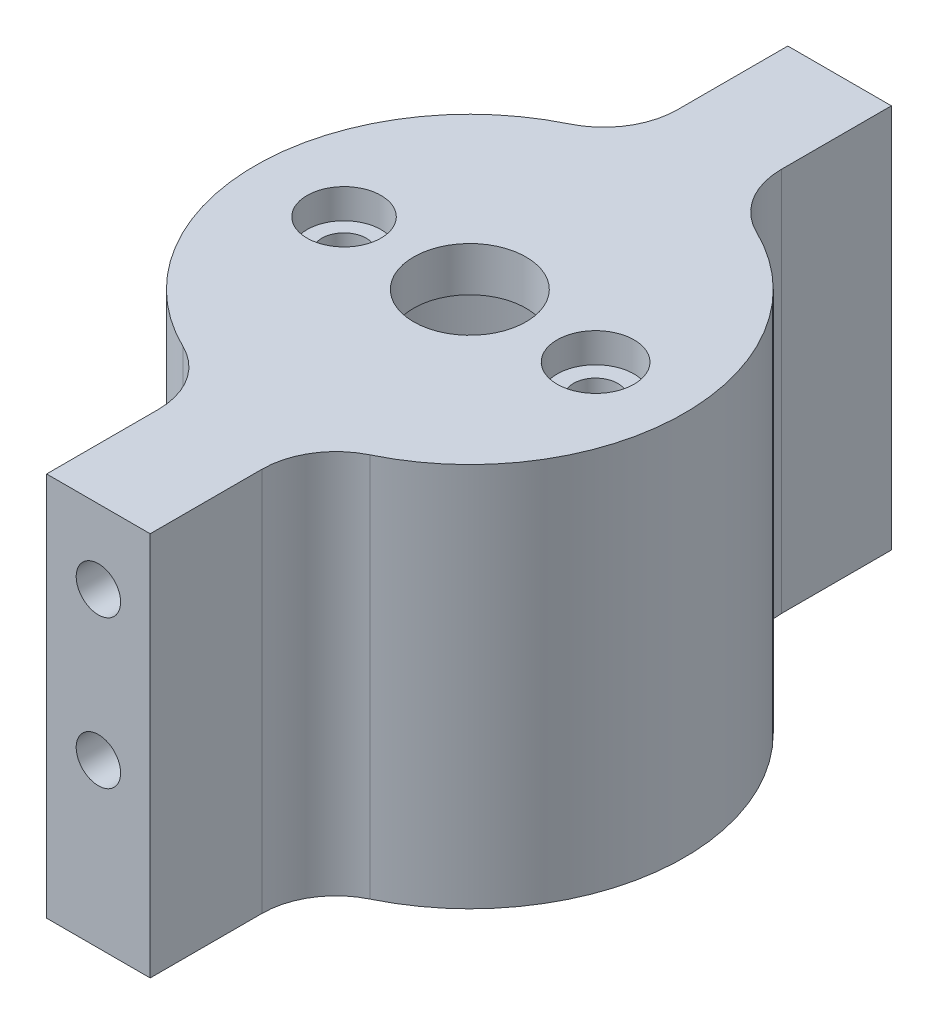
ISO-10303-21;
HEADER;
FILE_DESCRIPTION(('STEP AP214'),'2;1');
FILE_NAME('part.step','',(''),(''),'','','');
FILE_SCHEMA(('AUTOMOTIVE_DESIGN { 1 0 10303 214 1 1 1 1 }'));
ENDSEC;
DATA;
#1=APPLICATION_CONTEXT('core data for automotive mechanical design processes');
#2=APPLICATION_PROTOCOL_DEFINITION('international standard','automotive_design',2000,#1);
#3=PRODUCT_CONTEXT('',#1,'mechanical');
#4=PRODUCT('Part','Part','',(#3));
#5=PRODUCT_RELATED_PRODUCT_CATEGORY('part','',(#4));
#6=PRODUCT_DEFINITION_FORMATION('','',#4);
#7=PRODUCT_DEFINITION_CONTEXT('part definition',#1,'design');
#8=PRODUCT_DEFINITION('design','',#6,#7);
#9=PRODUCT_DEFINITION_SHAPE('','',#8);
#10=(LENGTH_UNIT() NAMED_UNIT(*) SI_UNIT(.MILLI.,.METRE.));
#11=(NAMED_UNIT(*) PLANE_ANGLE_UNIT() SI_UNIT($,.RADIAN.));
#12=(NAMED_UNIT(*) SI_UNIT($,.STERADIAN.) SOLID_ANGLE_UNIT());
#13=UNCERTAINTY_MEASURE_WITH_UNIT(LENGTH_MEASURE(1.E-05),#10,'distance_accuracy_value','');
#14=(GEOMETRIC_REPRESENTATION_CONTEXT(3) GLOBAL_UNCERTAINTY_ASSIGNED_CONTEXT((#13)) GLOBAL_UNIT_ASSIGNED_CONTEXT((#10,
#11,#12)) REPRESENTATION_CONTEXT('',''));
#15=CARTESIAN_POINT('',(0.,0.,0.));
#16=DIRECTION('',(0.,0.,1.));
#17=DIRECTION('',(1.,0.,0.));
#18=AXIS2_PLACEMENT_3D('',#15,#16,#17);
#19=CARTESIAN_POINT('',(0.,2.,0.));
#20=DIRECTION('',(0.,-1.,0.));
#21=DIRECTION('',(0.,0.,-1.));
#22=AXIS2_PLACEMENT_3D('',#19,#20,#21);
#23=CYLINDRICAL_SURFACE('',#22,14.5);
#24=CARTESIAN_POINT('',(0.,-23.,0.));
#25=DIRECTION('',(0.,-1.,0.));
#26=DIRECTION('',(0.,0.,-1.));
#27=AXIS2_PLACEMENT_3D('',#24,#25,#26);
#28=CIRCLE('',#27,14.5);
#29=CARTESIAN_POINT('',(6.32051282051282,-23.,-13.0499470376601));
#30=VERTEX_POINT('',#29);
#31=CARTESIAN_POINT('',(6.32051282051281,-23.,13.0499470376601));
#32=VERTEX_POINT('',#31);
#33=EDGE_CURVE('E268',#30,#32,#28,.T.);
#34=ORIENTED_EDGE('',*,*,#33,.F.);
#35=DIRECTION('',(0.,-1.,0.));
#36=VECTOR('',#35,1.);
#37=CARTESIAN_POINT('',(6.32051282051282,2.,-13.0499470376601));
#38=LINE('',#37,#36);
#39=CARTESIAN_POINT('',(6.32051282051282,3.,-13.0499470376601));
#40=VERTEX_POINT('',#39);
#41=EDGE_CURVE('E317',#30,#40,#38,.F.);
#42=ORIENTED_EDGE('',*,*,#41,.T.);
#43=CARTESIAN_POINT('',(0.,3.,0.));
#44=DIRECTION('',(0.,1.,0.));
#45=DIRECTION('',(0.,0.,1.));
#46=AXIS2_PLACEMENT_3D('',#43,#44,#45);
#47=CIRCLE('',#46,14.5);
#48=CARTESIAN_POINT('',(6.32051282051281,3.,13.0499470376601));
#49=VERTEX_POINT('',#48);
#50=EDGE_CURVE('E262',#49,#40,#47,.T.);
#51=ORIENTED_EDGE('',*,*,#50,.F.);
#52=DIRECTION('',(0.,-1.,0.));
#53=VECTOR('',#52,1.);
#54=CARTESIAN_POINT('',(6.32051282051281,2.,13.0499470376601));
#55=LINE('',#54,#53);
#56=EDGE_CURVE('E313',#49,#32,#55,.T.);
#57=ORIENTED_EDGE('',*,*,#56,.T.);
#58=EDGE_LOOP('',(#34,#42,#51,#57));
#59=FACE_BOUND('',#58,.T.);
#60=ADVANCED_FACE('F69',(#59),#23,.T.);
#61=CARTESIAN_POINT('',(-8.5,-0.5,0.));
#62=DIRECTION('',(0.,1.,0.));
#63=DIRECTION('',(0.,0.,1.));
#64=AXIS2_PLACEMENT_3D('',#61,#62,#63);
#65=CYLINDRICAL_SURFACE('',#64,1.5);
#66=CARTESIAN_POINT('',(-8.5,0.,0.));
#67=DIRECTION('',(0.,1.,0.));
#68=DIRECTION('',(0.,0.,1.));
#69=AXIS2_PLACEMENT_3D('',#66,#67,#68);
#70=CIRCLE('',#69,1.5);
#71=CARTESIAN_POINT('',(-8.5,0.,1.5));
#72=VERTEX_POINT('',#71);
#73=EDGE_CURVE('E285',#72,#72,#70,.T.);
#74=ORIENTED_EDGE('',*,*,#73,.F.);
#75=EDGE_LOOP('',(#74));
#76=FACE_BOUND('',#75,.T.);
#77=CARTESIAN_POINT('',(-8.5,1.,0.));
#78=DIRECTION('',(0.,1.,0.));
#79=DIRECTION('',(0.,0.,1.));
#80=AXIS2_PLACEMENT_3D('',#77,#78,#79);
#81=CIRCLE('',#80,1.5);
#82=CARTESIAN_POINT('',(-8.5,1.,1.5));
#83=VERTEX_POINT('',#82);
#84=EDGE_CURVE('E263',#83,#83,#81,.F.);
#85=ORIENTED_EDGE('',*,*,#84,.F.);
#86=EDGE_LOOP('',(#85));
#87=FACE_BOUND('',#86,.T.);
#88=ADVANCED_FACE('F363',(#76,#87),#65,.F.);
#89=CARTESIAN_POINT('',(8.5,-0.5,0.));
#90=DIRECTION('',(0.,1.,0.));
#91=DIRECTION('',(0.,0.,1.));
#92=AXIS2_PLACEMENT_3D('',#89,#90,#91);
#93=CYLINDRICAL_SURFACE('',#92,1.5);
#94=CARTESIAN_POINT('',(8.5,0.,0.));
#95=DIRECTION('',(0.,1.,0.));
#96=DIRECTION('',(0.,0.,1.));
#97=AXIS2_PLACEMENT_3D('',#94,#95,#96);
#98=CIRCLE('',#97,1.5);
#99=CARTESIAN_POINT('',(8.5,0.,1.5));
#100=VERTEX_POINT('',#99);
#101=EDGE_CURVE('E289',#100,#100,#98,.T.);
#102=ORIENTED_EDGE('',*,*,#101,.F.);
#103=EDGE_LOOP('',(#102));
#104=FACE_BOUND('',#103,.T.);
#105=CARTESIAN_POINT('',(8.5,1.,0.));
#106=DIRECTION('',(0.,1.,0.));
#107=DIRECTION('',(0.,0.,1.));
#108=AXIS2_PLACEMENT_3D('',#105,#106,#107);
#109=CIRCLE('',#108,1.5);
#110=CARTESIAN_POINT('',(8.5,1.,1.5));
#111=VERTEX_POINT('',#110);
#112=EDGE_CURVE('E246',#111,#111,#109,.F.);
#113=ORIENTED_EDGE('',*,*,#112,.F.);
#114=EDGE_LOOP('',(#113));
#115=FACE_BOUND('',#114,.T.);
#116=ADVANCED_FACE('F369',(#104,#115),#93,.F.);
#117=CARTESIAN_POINT('',(0.,0.,0.));
#118=DIRECTION('',(0.,1.,0.));
#119=DIRECTION('',(0.,0.,1.));
#120=AXIS2_PLACEMENT_3D('',#117,#118,#119);
#121=PLANE('',#120);
#122=CARTESIAN_POINT('',(0.,0.,0.));
#123=DIRECTION('',(0.,1.,0.));
#124=DIRECTION('',(0.,0.,1.));
#125=AXIS2_PLACEMENT_3D('',#122,#123,#124);
#126=CIRCLE('',#125,3.8);
#127=CARTESIAN_POINT('',(0.,0.,3.8));
#128=VERTEX_POINT('',#127);
#129=EDGE_CURVE('E281',#128,#128,#126,.T.);
#130=ORIENTED_EDGE('',*,*,#129,.T.);
#131=EDGE_LOOP('',(#130));
#132=FACE_BOUND('',#131,.T.);
#133=ORIENTED_EDGE('',*,*,#73,.T.);
#134=EDGE_LOOP('',(#133));
#135=FACE_BOUND('',#134,.T.);
#136=ORIENTED_EDGE('',*,*,#101,.T.);
#137=EDGE_LOOP('',(#136));
#138=FACE_BOUND('',#137,.T.);
#139=CARTESIAN_POINT('',(0.,0.,0.));
#140=DIRECTION('',(0.,-1.,0.));
#141=DIRECTION('',(0.,0.,-1.));
#142=AXIS2_PLACEMENT_3D('',#139,#140,#141);
#143=CIRCLE('',#142,12.5);
#144=CARTESIAN_POINT('',(0.,0.,-12.5));
#145=VERTEX_POINT('',#144);
#146=EDGE_CURVE('E272',#145,#145,#143,.T.);
#147=ORIENTED_EDGE('',*,*,#146,.T.);
#148=EDGE_LOOP('',(#147));
#149=FACE_BOUND('',#148,.T.);
#150=ADVANCED_FACE('F377',(#132,#135,#138,#149),#121,.F.);
#151=CARTESIAN_POINT('',(-6.32051282051282,3.,-13.0499470376601));
#152=VERTEX_POINT('',#151);
#153=CARTESIAN_POINT('',(-6.32051282051282,3.,13.0499470376601));
#154=VERTEX_POINT('',#153);
#155=EDGE_CURVE('E267',#152,#154,#47,.T.);
#156=ORIENTED_EDGE('',*,*,#155,.F.);
#157=DIRECTION('',(0.,-1.,0.));
#158=VECTOR('',#157,1.);
#159=CARTESIAN_POINT('',(-6.32051282051282,2.,-13.0499470376601));
#160=LINE('',#159,#158);
#161=CARTESIAN_POINT('',(-6.32051282051282,-23.,-13.0499470376601));
#162=VERTEX_POINT('',#161);
#163=EDGE_CURVE('E302',#152,#162,#160,.T.);
#164=ORIENTED_EDGE('',*,*,#163,.T.);
#165=CARTESIAN_POINT('',(-6.32051282051282,-23.,13.0499470376601));
#166=VERTEX_POINT('',#165);
#167=EDGE_CURVE('E273',#166,#162,#28,.T.);
#168=ORIENTED_EDGE('',*,*,#167,.F.);
#169=DIRECTION('',(0.,-1.,0.));
#170=VECTOR('',#169,1.);
#171=CARTESIAN_POINT('',(-6.32051282051282,2.,13.0499470376601));
#172=LINE('',#171,#170);
#173=EDGE_CURVE('E293',#166,#154,#172,.F.);
#174=ORIENTED_EDGE('',*,*,#173,.T.);
#175=EDGE_LOOP('',(#156,#164,#168,#174));
#176=FACE_BOUND('',#175,.T.);
#177=ADVANCED_FACE('F352',(#176),#23,.T.);
#178=CARTESIAN_POINT('',(0.,-0.5,0.));
#179=DIRECTION('',(0.,1.,0.));
#180=DIRECTION('',(0.,0.,1.));
#181=AXIS2_PLACEMENT_3D('',#178,#179,#180);
#182=CYLINDRICAL_SURFACE('',#181,3.8);
#183=ORIENTED_EDGE('',*,*,#129,.F.);
#184=EDGE_LOOP('',(#183));
#185=FACE_BOUND('',#184,.T.);
#186=CARTESIAN_POINT('',(0.,3.,0.));
#187=DIRECTION('',(0.,1.,0.));
#188=DIRECTION('',(0.,0.,1.));
#189=AXIS2_PLACEMENT_3D('',#186,#187,#188);
#190=CIRCLE('',#189,3.8);
#191=CARTESIAN_POINT('',(0.,3.,3.8));
#192=VERTEX_POINT('',#191);
#193=EDGE_CURVE('E258',#192,#192,#190,.T.);
#194=ORIENTED_EDGE('',*,*,#193,.T.);
#195=EDGE_LOOP('',(#194));
#196=FACE_BOUND('',#195,.T.);
#197=ADVANCED_FACE('F376',(#185,#196),#182,.F.);
#198=CARTESIAN_POINT('',(0.,-23.,0.));
#199=DIRECTION('',(0.,-1.,0.));
#200=DIRECTION('',(0.,0.,-1.));
#201=AXIS2_PLACEMENT_3D('',#198,#199,#200);
#202=PLANE('',#201);
#203=DIRECTION('',(-1.,0.,0.));
#204=VECTOR('',#203,1.);
#205=CARTESIAN_POINT('',(3.5,-23.,-24.99));
#206=LINE('',#205,#204);
#207=CARTESIAN_POINT('',(3.5,-23.,-24.99));
#208=VERTEX_POINT('',#207);
#209=CARTESIAN_POINT('',(-3.49999999999999,-23.,-24.99));
#210=VERTEX_POINT('',#209);
#211=EDGE_CURVE('E202',#208,#210,#206,.T.);
#212=ORIENTED_EDGE('',*,*,#211,.F.);
#213=DIRECTION('',(0.,0.,1.));
#214=VECTOR('',#213,1.);
#215=CARTESIAN_POINT('',(3.5,-23.,-25.1));
#216=LINE('',#215,#214);
#217=CARTESIAN_POINT('',(3.5,-23.,-17.5499287747842));
#218=VERTEX_POINT('',#217);
#219=EDGE_CURVE('E232',#208,#218,#216,.T.);
#220=ORIENTED_EDGE('',*,*,#219,.T.);
#221=CARTESIAN_POINT('',(8.49999999999999,-23.,-17.5499287747842));
#222=DIRECTION('',(0.,-1.,0.));
#223=DIRECTION('',(0.,0.,-1.));
#224=AXIS2_PLACEMENT_3D('',#221,#222,#223);
#225=CIRCLE('',#224,5.);
#226=EDGE_CURVE('E332',#218,#30,#225,.F.);
#227=ORIENTED_EDGE('',*,*,#226,.T.);
#228=ORIENTED_EDGE('',*,*,#33,.T.);
#229=CARTESIAN_POINT('',(8.49999999999998,-23.,17.5499287747842));
#230=DIRECTION('',(0.,-1.,0.));
#231=DIRECTION('',(0.,0.,-1.));
#232=AXIS2_PLACEMENT_3D('',#229,#230,#231);
#233=CIRCLE('',#232,5.);
#234=CARTESIAN_POINT('',(3.49999999999998,-23.,17.5499287747843));
#235=VERTEX_POINT('',#234);
#236=EDGE_CURVE('E338',#32,#235,#233,.F.);
#237=ORIENTED_EDGE('',*,*,#236,.T.);
#238=DIRECTION('',(0.,0.,-1.));
#239=VECTOR('',#238,1.);
#240=CARTESIAN_POINT('',(3.5,-23.,25.1));
#241=LINE('',#240,#239);
#242=CARTESIAN_POINT('',(3.5,-23.,25.1));
#243=VERTEX_POINT('',#242);
#244=EDGE_CURVE('E188',#243,#235,#241,.T.);
#245=ORIENTED_EDGE('',*,*,#244,.F.);
#246=DIRECTION('',(-1.,0.,0.));
#247=VECTOR('',#246,1.);
#248=CARTESIAN_POINT('',(3.5,-23.,25.1));
#249=LINE('',#248,#247);
#250=CARTESIAN_POINT('',(-3.5,-23.,25.1));
#251=VERTEX_POINT('',#250);
#252=EDGE_CURVE('E195',#243,#251,#249,.T.);
#253=ORIENTED_EDGE('',*,*,#252,.T.);
#254=DIRECTION('',(0.,0.,-1.));
#255=VECTOR('',#254,1.);
#256=CARTESIAN_POINT('',(-3.5,-23.,25.1));
#257=LINE('',#256,#255);
#258=CARTESIAN_POINT('',(-3.5,-23.,17.5499287747842));
#259=VERTEX_POINT('',#258);
#260=EDGE_CURVE('E162',#251,#259,#257,.T.);
#261=ORIENTED_EDGE('',*,*,#260,.T.);
#262=CARTESIAN_POINT('',(-8.49999999999999,-23.,17.5499287747842));
#263=DIRECTION('',(0.,-1.,0.));
#264=DIRECTION('',(0.,0.,-1.));
#265=AXIS2_PLACEMENT_3D('',#262,#263,#264);
#266=CIRCLE('',#265,5.);
#267=EDGE_CURVE('E78',#259,#166,#266,.F.);
#268=ORIENTED_EDGE('',*,*,#267,.T.);
#269=ORIENTED_EDGE('',*,*,#167,.T.);
#270=CARTESIAN_POINT('',(-8.49999999999999,-23.,-17.5499287747842));
#271=DIRECTION('',(0.,-1.,0.));
#272=DIRECTION('',(0.,0.,-1.));
#273=AXIS2_PLACEMENT_3D('',#270,#271,#272);
#274=CIRCLE('',#273,5.);
#275=CARTESIAN_POINT('',(-3.5,-23.,-17.5499287747842));
#276=VERTEX_POINT('',#275);
#277=EDGE_CURVE('E326',#162,#276,#274,.F.);
#278=ORIENTED_EDGE('',*,*,#277,.T.);
#279=DIRECTION('',(0.,0.,-1.));
#280=VECTOR('',#279,1.);
#281=CARTESIAN_POINT('',(-3.5,-23.,-25.1));
#282=LINE('',#281,#280);
#283=EDGE_CURVE('E227',#276,#210,#282,.T.);
#284=ORIENTED_EDGE('',*,*,#283,.T.);
#285=EDGE_LOOP('',(#212,#220,#227,#228,#237,#245,#253,#261,#268,#269,#278,#284));
#286=FACE_BOUND('',#285,.T.);
#287=CARTESIAN_POINT('',(0.,-23.,0.));
#288=DIRECTION('',(0.,-1.,0.));
#289=DIRECTION('',(0.,0.,-1.));
#290=AXIS2_PLACEMENT_3D('',#287,#288,#289);
#291=CIRCLE('',#290,12.5);
#292=CARTESIAN_POINT('',(0.,-23.,-12.5));
#293=VERTEX_POINT('',#292);
#294=EDGE_CURVE('E277',#293,#293,#291,.T.);
#295=ORIENTED_EDGE('',*,*,#294,.F.);
#296=EDGE_LOOP('',(#295));
#297=FACE_BOUND('',#296,.T.);
#298=ADVANCED_FACE('F348',(#286,#297),#202,.T.);
#299=CARTESIAN_POINT('',(0.,-23.,0.));
#300=DIRECTION('',(0.,1.,0.));
#301=DIRECTION('',(0.,0.,1.));
#302=AXIS2_PLACEMENT_3D('',#299,#300,#301);
#303=CYLINDRICAL_SURFACE('',#302,12.5);
#304=ORIENTED_EDGE('',*,*,#294,.T.);
#305=EDGE_LOOP('',(#304));
#306=FACE_BOUND('',#305,.T.);
#307=ORIENTED_EDGE('',*,*,#146,.F.);
#308=EDGE_LOOP('',(#307));
#309=FACE_BOUND('',#308,.T.);
#310=ADVANCED_FACE('F394',(#306,#309),#303,.F.);
#311=CARTESIAN_POINT('',(0.,3.,0.));
#312=DIRECTION('',(0.,1.,0.));
#313=DIRECTION('',(0.,0.,1.));
#314=AXIS2_PLACEMENT_3D('',#311,#312,#313);
#315=PLANE('',#314);
#316=DIRECTION('',(-1.,0.,0.));
#317=VECTOR('',#316,1.);
#318=CARTESIAN_POINT('',(3.5,3.00000000000001,-24.99));
#319=LINE('',#318,#317);
#320=CARTESIAN_POINT('',(3.5,3.00000000000001,-24.99));
#321=VERTEX_POINT('',#320);
#322=CARTESIAN_POINT('',(-3.49999999999999,3.00000000000001,-24.99));
#323=VERTEX_POINT('',#322);
#324=EDGE_CURVE('E221',#321,#323,#319,.T.);
#325=ORIENTED_EDGE('',*,*,#324,.T.);
#326=DIRECTION('',(0.,0.,-1.));
#327=VECTOR('',#326,1.);
#328=CARTESIAN_POINT('',(-3.5,3.00000000000001,-25.1));
#329=LINE('',#328,#327);
#330=CARTESIAN_POINT('',(-3.5,3.00000000000001,-17.5499287747842));
#331=VERTEX_POINT('',#330);
#332=EDGE_CURVE('E228',#331,#323,#329,.T.);
#333=ORIENTED_EDGE('',*,*,#332,.F.);
#334=CARTESIAN_POINT('',(-8.49999999999999,3.,-17.5499287747842));
#335=DIRECTION('',(0.,1.,0.));
#336=DIRECTION('',(0.,0.,1.));
#337=AXIS2_PLACEMENT_3D('',#334,#335,#336);
#338=CIRCLE('',#337,5.);
#339=EDGE_CURVE('E329',#331,#152,#338,.F.);
#340=ORIENTED_EDGE('',*,*,#339,.T.);
#341=ORIENTED_EDGE('',*,*,#155,.T.);
#342=CARTESIAN_POINT('',(-8.49999999999999,3.,17.5499287747842));
#343=DIRECTION('',(0.,1.,0.));
#344=DIRECTION('',(0.,0.,1.));
#345=AXIS2_PLACEMENT_3D('',#342,#343,#344);
#346=CIRCLE('',#345,5.);
#347=CARTESIAN_POINT('',(-3.5,3.00000000000001,17.5499287747842));
#348=VERTEX_POINT('',#347);
#349=EDGE_CURVE('E12',#154,#348,#346,.F.);
#350=ORIENTED_EDGE('',*,*,#349,.T.);
#351=DIRECTION('',(0.,0.,-1.));
#352=VECTOR('',#351,1.);
#353=CARTESIAN_POINT('',(-3.5,3.00000000000001,25.1));
#354=LINE('',#353,#352);
#355=CARTESIAN_POINT('',(-3.5,3.00000000000001,25.1));
#356=VERTEX_POINT('',#355);
#357=EDGE_CURVE('E160',#356,#348,#354,.T.);
#358=ORIENTED_EDGE('',*,*,#357,.F.);
#359=DIRECTION('',(-1.,0.,0.));
#360=VECTOR('',#359,1.);
#361=CARTESIAN_POINT('',(3.5,3.00000000000001,25.1));
#362=LINE('',#361,#360);
#363=CARTESIAN_POINT('',(3.5,3.00000000000001,25.1));
#364=VERTEX_POINT('',#363);
#365=EDGE_CURVE('E176',#364,#356,#362,.T.);
#366=ORIENTED_EDGE('',*,*,#365,.F.);
#367=DIRECTION('',(0.,0.,-1.));
#368=VECTOR('',#367,1.);
#369=CARTESIAN_POINT('',(3.5,3.00000000000001,25.1));
#370=LINE('',#369,#368);
#371=CARTESIAN_POINT('',(3.49999999999998,3.00000000000001,17.5499287747843));
#372=VERTEX_POINT('',#371);
#373=EDGE_CURVE('E178',#364,#372,#370,.T.);
#374=ORIENTED_EDGE('',*,*,#373,.T.);
#375=CARTESIAN_POINT('',(8.49999999999998,3.,17.5499287747842));
#376=DIRECTION('',(0.,1.,0.));
#377=DIRECTION('',(0.,0.,1.));
#378=AXIS2_PLACEMENT_3D('',#375,#376,#377);
#379=CIRCLE('',#378,5.);
#380=EDGE_CURVE('E341',#372,#49,#379,.F.);
#381=ORIENTED_EDGE('',*,*,#380,.T.);
#382=ORIENTED_EDGE('',*,*,#50,.T.);
#383=CARTESIAN_POINT('',(8.49999999999999,3.,-17.5499287747842));
#384=DIRECTION('',(0.,1.,0.));
#385=DIRECTION('',(0.,0.,1.));
#386=AXIS2_PLACEMENT_3D('',#383,#384,#385);
#387=CIRCLE('',#386,5.);
#388=CARTESIAN_POINT('',(3.5,3.00000000000001,-17.5499287747842));
#389=VERTEX_POINT('',#388);
#390=EDGE_CURVE('E335',#40,#389,#387,.F.);
#391=ORIENTED_EDGE('',*,*,#390,.T.);
#392=DIRECTION('',(0.,0.,1.));
#393=VECTOR('',#392,1.);
#394=CARTESIAN_POINT('',(3.5,3.00000000000001,-25.1));
#395=LINE('',#394,#393);
#396=EDGE_CURVE('E231',#321,#389,#395,.T.);
#397=ORIENTED_EDGE('',*,*,#396,.F.);
#398=EDGE_LOOP('',(#325,#333,#340,#341,#350,#358,#366,#374,#381,#382,#391,#397));
#399=FACE_BOUND('',#398,.T.);
#400=CARTESIAN_POINT('',(8.5,3.,0.));
#401=DIRECTION('',(0.,1.,0.));
#402=DIRECTION('',(0.,0.,1.));
#403=AXIS2_PLACEMENT_3D('',#400,#401,#402);
#404=CIRCLE('',#403,2.6);
#405=CARTESIAN_POINT('',(8.5,3.,2.6));
#406=VERTEX_POINT('',#405);
#407=EDGE_CURVE('E247',#406,#406,#404,.T.);
#408=ORIENTED_EDGE('',*,*,#407,.F.);
#409=EDGE_LOOP('',(#408));
#410=FACE_BOUND('',#409,.T.);
#411=CARTESIAN_POINT('',(-8.5,3.,0.));
#412=DIRECTION('',(0.,1.,0.));
#413=DIRECTION('',(0.,0.,1.));
#414=AXIS2_PLACEMENT_3D('',#411,#412,#413);
#415=CIRCLE('',#414,2.5);
#416=CARTESIAN_POINT('',(-8.5,3.,2.5));
#417=VERTEX_POINT('',#416);
#418=EDGE_CURVE('E251',#417,#417,#415,.T.);
#419=ORIENTED_EDGE('',*,*,#418,.F.);
#420=EDGE_LOOP('',(#419));
#421=FACE_BOUND('',#420,.T.);
#422=ORIENTED_EDGE('',*,*,#193,.F.);
#423=EDGE_LOOP('',(#422));
#424=FACE_BOUND('',#423,.T.);
#425=ADVANCED_FACE('F173',(#399,#410,#421,#424),#315,.T.);
#426=CARTESIAN_POINT('',(-8.5,1.,0.));
#427=DIRECTION('',(0.,1.,0.));
#428=DIRECTION('',(0.,0.,1.));
#429=AXIS2_PLACEMENT_3D('',#426,#427,#428);
#430=PLANE('',#429);
#431=CARTESIAN_POINT('',(-8.5,1.,0.));
#432=DIRECTION('',(0.,1.,0.));
#433=DIRECTION('',(0.,0.,1.));
#434=AXIS2_PLACEMENT_3D('',#431,#432,#433);
#435=CIRCLE('',#434,2.5);
#436=CARTESIAN_POINT('',(-8.5,1.,2.5));
#437=VERTEX_POINT('',#436);
#438=EDGE_CURVE('E236',#437,#437,#435,.T.);
#439=ORIENTED_EDGE('',*,*,#438,.T.);
#440=EDGE_LOOP('',(#439));
#441=FACE_BOUND('',#440,.T.);
#442=ORIENTED_EDGE('',*,*,#84,.T.);
#443=EDGE_LOOP('',(#442));
#444=FACE_BOUND('',#443,.T.);
#445=ADVANCED_FACE('F400',(#441,#444),#430,.T.);
#446=CARTESIAN_POINT('',(-8.5,1.,0.));
#447=DIRECTION('',(0.,1.,0.));
#448=DIRECTION('',(0.,0.,1.));
#449=AXIS2_PLACEMENT_3D('',#446,#447,#448);
#450=CYLINDRICAL_SURFACE('',#449,2.5);
#451=ORIENTED_EDGE('',*,*,#438,.F.);
#452=EDGE_LOOP('',(#451));
#453=FACE_BOUND('',#452,.T.);
#454=ORIENTED_EDGE('',*,*,#418,.T.);
#455=EDGE_LOOP('',(#454));
#456=FACE_BOUND('',#455,.T.);
#457=ADVANCED_FACE('F403',(#453,#456),#450,.F.);
#458=CARTESIAN_POINT('',(8.5,1.,0.));
#459=DIRECTION('',(0.,1.,0.));
#460=DIRECTION('',(0.,0.,1.));
#461=AXIS2_PLACEMENT_3D('',#458,#459,#460);
#462=PLANE('',#461);
#463=CARTESIAN_POINT('',(8.5,1.,0.));
#464=DIRECTION('',(0.,1.,0.));
#465=DIRECTION('',(0.,0.,1.));
#466=AXIS2_PLACEMENT_3D('',#463,#464,#465);
#467=CIRCLE('',#466,2.6);
#468=CARTESIAN_POINT('',(8.5,1.,2.6));
#469=VERTEX_POINT('',#468);
#470=EDGE_CURVE('E242',#469,#469,#467,.T.);
#471=ORIENTED_EDGE('',*,*,#470,.T.);
#472=EDGE_LOOP('',(#471));
#473=FACE_BOUND('',#472,.T.);
#474=ORIENTED_EDGE('',*,*,#112,.T.);
#475=EDGE_LOOP('',(#474));
#476=FACE_BOUND('',#475,.T.);
#477=ADVANCED_FACE('F407',(#473,#476),#462,.T.);
#478=CARTESIAN_POINT('',(8.5,1.,0.));
#479=DIRECTION('',(0.,1.,0.));
#480=DIRECTION('',(0.,0.,1.));
#481=AXIS2_PLACEMENT_3D('',#478,#479,#480);
#482=CYLINDRICAL_SURFACE('',#481,2.6);
#483=ORIENTED_EDGE('',*,*,#470,.F.);
#484=EDGE_LOOP('',(#483));
#485=FACE_BOUND('',#484,.T.);
#486=ORIENTED_EDGE('',*,*,#407,.T.);
#487=EDGE_LOOP('',(#486));
#488=FACE_BOUND('',#487,.T.);
#489=ADVANCED_FACE('F409',(#485,#488),#482,.F.);
#490=CARTESIAN_POINT('',(-3.5,3.00000000000001,-25.1));
#491=DIRECTION('',(-1.,0.,0.));
#492=DIRECTION('',(0.,0.,1.));
#493=AXIS2_PLACEMENT_3D('',#490,#491,#492);
#494=PLANE('',#493);
#495=ORIENTED_EDGE('',*,*,#283,.F.);
#496=DIRECTION('',(0.,-1.,0.));
#497=VECTOR('',#496,1.);
#498=CARTESIAN_POINT('',(-3.5,3.00000000000001,-17.5499287747842));
#499=LINE('',#498,#497);
#500=EDGE_CURVE('E306',#276,#331,#499,.F.);
#501=ORIENTED_EDGE('',*,*,#500,.T.);
#502=ORIENTED_EDGE('',*,*,#332,.T.);
#503=DIRECTION('',(0.,-1.,0.));
#504=VECTOR('',#503,1.);
#505=CARTESIAN_POINT('',(-3.49999999999999,3.00000000000001,-24.99));
#506=LINE('',#505,#504);
#507=EDGE_CURVE('E217',#323,#210,#506,.T.);
#508=ORIENTED_EDGE('',*,*,#507,.T.);
#509=EDGE_LOOP('',(#495,#501,#502,#508));
#510=FACE_BOUND('',#509,.T.);
#511=ADVANCED_FACE('F412',(#510),#494,.T.);
#512=CARTESIAN_POINT('',(3.5,3.00000000000001,-25.1));
#513=DIRECTION('',(1.,0.,0.));
#514=DIRECTION('',(0.,0.,-1.));
#515=AXIS2_PLACEMENT_3D('',#512,#513,#514);
#516=PLANE('',#515);
#517=ORIENTED_EDGE('',*,*,#396,.T.);
#518=DIRECTION('',(0.,-1.,0.));
#519=VECTOR('',#518,1.);
#520=CARTESIAN_POINT('',(3.5,3.00000000000001,-17.5499287747842));
#521=LINE('',#520,#519);
#522=EDGE_CURVE('E309',#389,#218,#521,.T.);
#523=ORIENTED_EDGE('',*,*,#522,.T.);
#524=ORIENTED_EDGE('',*,*,#219,.F.);
#525=DIRECTION('',(0.,-1.,0.));
#526=VECTOR('',#525,1.);
#527=CARTESIAN_POINT('',(3.5,3.00000000000001,-24.99));
#528=LINE('',#527,#526);
#529=EDGE_CURVE('E224',#321,#208,#528,.T.);
#530=ORIENTED_EDGE('',*,*,#529,.F.);
#531=EDGE_LOOP('',(#517,#523,#524,#530));
#532=FACE_BOUND('',#531,.T.);
#533=ADVANCED_FACE('F419',(#532),#516,.T.);
#534=CARTESIAN_POINT('',(0.,0.,-24.99));
#535=DIRECTION('',(0.,0.,1.));
#536=DIRECTION('',(1.,0.,0.));
#537=AXIS2_PLACEMENT_3D('',#534,#535,#536);
#538=PLANE('',#537);
#539=CARTESIAN_POINT('',(0.,-1.99999999999999,-24.99));
#540=DIRECTION('',(0.,0.,-1.));
#541=DIRECTION('',(-1.,0.,0.));
#542=AXIS2_PLACEMENT_3D('',#539,#540,#541);
#543=CIRCLE('',#542,1.5);
#544=CARTESIAN_POINT('',(-1.5,-1.99999999999999,-24.99));
#545=VERTEX_POINT('',#544);
#546=EDGE_CURVE('E203',#545,#545,#543,.T.);
#547=ORIENTED_EDGE('',*,*,#546,.F.);
#548=EDGE_LOOP('',(#547));
#549=FACE_BOUND('',#548,.T.);
#550=CARTESIAN_POINT('',(0.,-12.,-24.99));
#551=DIRECTION('',(0.,0.,-1.));
#552=DIRECTION('',(-1.,0.,0.));
#553=AXIS2_PLACEMENT_3D('',#550,#551,#552);
#554=CIRCLE('',#553,1.5);
#555=CARTESIAN_POINT('',(-1.5,-12.,-24.99));
#556=VERTEX_POINT('',#555);
#557=EDGE_CURVE('E207',#556,#556,#554,.T.);
#558=ORIENTED_EDGE('',*,*,#557,.F.);
#559=EDGE_LOOP('',(#558));
#560=FACE_BOUND('',#559,.T.);
#561=ORIENTED_EDGE('',*,*,#211,.T.);
#562=ORIENTED_EDGE('',*,*,#507,.F.);
#563=ORIENTED_EDGE('',*,*,#324,.F.);
#564=ORIENTED_EDGE('',*,*,#529,.T.);
#565=EDGE_LOOP('',(#561,#562,#563,#564));
#566=FACE_BOUND('',#565,.T.);
#567=ADVANCED_FACE('F423',(#549,#560,#566),#538,.F.);
#568=CARTESIAN_POINT('',(0.,-12.,-18.99));
#569=DIRECTION('',(0.,0.,-1.));
#570=DIRECTION('',(-1.,0.,0.));
#571=AXIS2_PLACEMENT_3D('',#568,#569,#570);
#572=CYLINDRICAL_SURFACE('',#571,1.5);
#573=CARTESIAN_POINT('',(0.,-12.,-18.99));
#574=DIRECTION('',(0.,0.,-1.));
#575=DIRECTION('',(-1.,0.,0.));
#576=AXIS2_PLACEMENT_3D('',#573,#574,#575);
#577=CIRCLE('',#576,1.5);
#578=CARTESIAN_POINT('',(-1.5,-12.,-18.99));
#579=VERTEX_POINT('',#578);
#580=EDGE_CURVE('E168',#579,#579,#577,.T.);
#581=ORIENTED_EDGE('',*,*,#580,.F.);
#582=EDGE_LOOP('',(#581));
#583=FACE_BOUND('',#582,.T.);
#584=ORIENTED_EDGE('',*,*,#557,.T.);
#585=EDGE_LOOP('',(#584));
#586=FACE_BOUND('',#585,.T.);
#587=ADVANCED_FACE('F427',(#583,#586),#572,.F.);
#588=CARTESIAN_POINT('',(0.,-12.,-18.99));
#589=DIRECTION('',(0.,0.,-1.));
#590=DIRECTION('',(-1.,0.,0.));
#591=AXIS2_PLACEMENT_3D('',#588,#589,#590);
#592=PLANE('',#591);
#593=ORIENTED_EDGE('',*,*,#580,.T.);
#594=EDGE_LOOP('',(#593));
#595=FACE_BOUND('',#594,.T.);
#596=ADVANCED_FACE('F429',(#595),#592,.T.);
#597=CARTESIAN_POINT('',(0.,-1.99999999999999,-18.99));
#598=DIRECTION('',(0.,0.,-1.));
#599=DIRECTION('',(-1.,0.,0.));
#600=AXIS2_PLACEMENT_3D('',#597,#598,#599);
#601=CYLINDRICAL_SURFACE('',#600,1.5);
#602=CARTESIAN_POINT('',(0.,-1.99999999999999,-18.99));
#603=DIRECTION('',(0.,0.,-1.));
#604=DIRECTION('',(-1.,0.,0.));
#605=AXIS2_PLACEMENT_3D('',#602,#603,#604);
#606=CIRCLE('',#605,1.5);
#607=CARTESIAN_POINT('',(-1.5,-1.99999999999999,-18.99));
#608=VERTEX_POINT('',#607);
#609=EDGE_CURVE('E198',#608,#608,#606,.T.);
#610=ORIENTED_EDGE('',*,*,#609,.F.);
#611=EDGE_LOOP('',(#610));
#612=FACE_BOUND('',#611,.T.);
#613=ORIENTED_EDGE('',*,*,#546,.T.);
#614=EDGE_LOOP('',(#613));
#615=FACE_BOUND('',#614,.T.);
#616=ADVANCED_FACE('F432',(#612,#615),#601,.F.);
#617=CARTESIAN_POINT('',(0.,-1.99999999999999,-18.99));
#618=DIRECTION('',(0.,0.,-1.));
#619=DIRECTION('',(-1.,0.,0.));
#620=AXIS2_PLACEMENT_3D('',#617,#618,#619);
#621=PLANE('',#620);
#622=ORIENTED_EDGE('',*,*,#609,.T.);
#623=EDGE_LOOP('',(#622));
#624=FACE_BOUND('',#623,.T.);
#625=ADVANCED_FACE('F439',(#624),#621,.T.);
#626=CARTESIAN_POINT('',(3.5,3.00000000000001,25.1));
#627=DIRECTION('',(-1.,0.,0.));
#628=DIRECTION('',(0.,0.,1.));
#629=AXIS2_PLACEMENT_3D('',#626,#627,#628);
#630=PLANE('',#629);
#631=ORIENTED_EDGE('',*,*,#244,.T.);
#632=DIRECTION('',(0.,1.,0.));
#633=VECTOR('',#632,1.);
#634=CARTESIAN_POINT('',(3.49999999999998,3.,17.5499287747843));
#635=LINE('',#634,#633);
#636=EDGE_CURVE('E320',#235,#372,#635,.T.);
#637=ORIENTED_EDGE('',*,*,#636,.T.);
#638=ORIENTED_EDGE('',*,*,#373,.F.);
#639=DIRECTION('',(0.,-1.,0.));
#640=VECTOR('',#639,1.);
#641=CARTESIAN_POINT('',(3.5,3.00000000000001,25.1));
#642=LINE('',#641,#640);
#643=EDGE_CURVE('E169',#364,#243,#642,.T.);
#644=ORIENTED_EDGE('',*,*,#643,.T.);
#645=EDGE_LOOP('',(#631,#637,#638,#644));
#646=FACE_BOUND('',#645,.T.);
#647=ADVANCED_FACE('F443',(#646),#630,.F.);
#648=CARTESIAN_POINT('',(-3.5,3.00000000000001,25.1));
#649=DIRECTION('',(-1.,0.,0.));
#650=DIRECTION('',(0.,0.,1.));
#651=AXIS2_PLACEMENT_3D('',#648,#649,#650);
#652=PLANE('',#651);
#653=ORIENTED_EDGE('',*,*,#357,.T.);
#654=DIRECTION('',(0.,-1.,0.));
#655=VECTOR('',#654,1.);
#656=CARTESIAN_POINT('',(-3.5,3.00000000000001,17.5499287747842));
#657=LINE('',#656,#655);
#658=EDGE_CURVE('E323',#348,#259,#657,.T.);
#659=ORIENTED_EDGE('',*,*,#658,.T.);
#660=ORIENTED_EDGE('',*,*,#260,.F.);
#661=DIRECTION('',(0.,-1.,0.));
#662=VECTOR('',#661,1.);
#663=CARTESIAN_POINT('',(-3.5,3.00000000000001,25.1));
#664=LINE('',#663,#662);
#665=EDGE_CURVE('E158',#356,#251,#664,.T.);
#666=ORIENTED_EDGE('',*,*,#665,.F.);
#667=EDGE_LOOP('',(#653,#659,#660,#666));
#668=FACE_BOUND('',#667,.T.);
#669=ADVANCED_FACE('F159',(#668),#652,.T.);
#670=CARTESIAN_POINT('',(3.5,3.00000000000001,25.1));
#671=DIRECTION('',(0.,0.,1.));
#672=DIRECTION('',(1.,0.,0.));
#673=AXIS2_PLACEMENT_3D('',#670,#671,#672);
#674=PLANE('',#673);
#675=CARTESIAN_POINT('',(0.,-1.99999999999999,25.1));
#676=DIRECTION('',(0.,0.,1.));
#677=DIRECTION('',(1.,0.,0.));
#678=AXIS2_PLACEMENT_3D('',#675,#676,#677);
#679=CIRCLE('',#678,1.5);
#680=CARTESIAN_POINT('',(1.5,-1.99999999999999,25.1));
#681=VERTEX_POINT('',#680);
#682=EDGE_CURVE('E476',#681,#681,#679,.T.);
#683=ORIENTED_EDGE('',*,*,#682,.F.);
#684=EDGE_LOOP('',(#683));
#685=FACE_BOUND('',#684,.T.);
#686=CARTESIAN_POINT('',(0.,-12.,25.1));
#687=DIRECTION('',(0.,0.,1.));
#688=DIRECTION('',(1.,0.,0.));
#689=AXIS2_PLACEMENT_3D('',#686,#687,#688);
#690=CIRCLE('',#689,1.5);
#691=CARTESIAN_POINT('',(1.5,-12.,25.1));
#692=VERTEX_POINT('',#691);
#693=EDGE_CURVE('E480',#692,#692,#690,.T.);
#694=ORIENTED_EDGE('',*,*,#693,.F.);
#695=EDGE_LOOP('',(#694));
#696=FACE_BOUND('',#695,.T.);
#697=ORIENTED_EDGE('',*,*,#252,.F.);
#698=ORIENTED_EDGE('',*,*,#643,.F.);
#699=ORIENTED_EDGE('',*,*,#365,.T.);
#700=ORIENTED_EDGE('',*,*,#665,.T.);
#701=EDGE_LOOP('',(#697,#698,#699,#700));
#702=FACE_BOUND('',#701,.T.);
#703=ADVANCED_FACE('F180',(#685,#696,#702),#674,.T.);
#704=CARTESIAN_POINT('',(0.,-12.,20.1));
#705=DIRECTION('',(0.,0.,1.));
#706=DIRECTION('',(1.,0.,0.));
#707=AXIS2_PLACEMENT_3D('',#704,#705,#706);
#708=CYLINDRICAL_SURFACE('',#707,1.5);
#709=CARTESIAN_POINT('',(0.,-12.,20.1));
#710=DIRECTION('',(0.,0.,1.));
#711=DIRECTION('',(1.,0.,0.));
#712=AXIS2_PLACEMENT_3D('',#709,#710,#711);
#713=CIRCLE('',#712,1.5);
#714=CARTESIAN_POINT('',(1.5,-12.,20.1));
#715=VERTEX_POINT('',#714);
#716=EDGE_CURVE('E486',#715,#715,#713,.T.);
#717=ORIENTED_EDGE('',*,*,#716,.F.);
#718=EDGE_LOOP('',(#717));
#719=FACE_BOUND('',#718,.T.);
#720=ORIENTED_EDGE('',*,*,#693,.T.);
#721=EDGE_LOOP('',(#720));
#722=FACE_BOUND('',#721,.T.);
#723=ADVANCED_FACE('F452',(#719,#722),#708,.F.);
#724=CARTESIAN_POINT('',(0.,-12.,20.1));
#725=DIRECTION('',(0.,0.,1.));
#726=DIRECTION('',(1.,0.,0.));
#727=AXIS2_PLACEMENT_3D('',#724,#725,#726);
#728=PLANE('',#727);
#729=ORIENTED_EDGE('',*,*,#716,.T.);
#730=EDGE_LOOP('',(#729));
#731=FACE_BOUND('',#730,.T.);
#732=ADVANCED_FACE('F454',(#731),#728,.T.);
#733=CARTESIAN_POINT('',(0.,-1.99999999999999,20.1));
#734=DIRECTION('',(0.,0.,1.));
#735=DIRECTION('',(1.,0.,0.));
#736=AXIS2_PLACEMENT_3D('',#733,#734,#735);
#737=CYLINDRICAL_SURFACE('',#736,1.5);
#738=CARTESIAN_POINT('',(0.,-1.99999999999999,20.1));
#739=DIRECTION('',(0.,0.,1.));
#740=DIRECTION('',(1.,0.,0.));
#741=AXIS2_PLACEMENT_3D('',#738,#739,#740);
#742=CIRCLE('',#741,1.5);
#743=CARTESIAN_POINT('',(1.5,-1.99999999999999,20.1));
#744=VERTEX_POINT('',#743);
#745=EDGE_CURVE('E192',#744,#744,#742,.T.);
#746=ORIENTED_EDGE('',*,*,#745,.F.);
#747=EDGE_LOOP('',(#746));
#748=FACE_BOUND('',#747,.T.);
#749=ORIENTED_EDGE('',*,*,#682,.T.);
#750=EDGE_LOOP('',(#749));
#751=FACE_BOUND('',#750,.T.);
#752=ADVANCED_FACE('F457',(#748,#751),#737,.F.);
#753=CARTESIAN_POINT('',(0.,-1.99999999999999,20.1));
#754=DIRECTION('',(0.,0.,1.));
#755=DIRECTION('',(1.,0.,0.));
#756=AXIS2_PLACEMENT_3D('',#753,#754,#755);
#757=PLANE('',#756);
#758=ORIENTED_EDGE('',*,*,#745,.T.);
#759=EDGE_LOOP('',(#758));
#760=FACE_BOUND('',#759,.T.);
#761=ADVANCED_FACE('F464',(#760),#757,.T.);
#762=CARTESIAN_POINT('',(-8.49999999999999,2.,-17.5499287747842));
#763=DIRECTION('',(0.,-1.,0.));
#764=DIRECTION('',(0.,0.,-1.));
#765=AXIS2_PLACEMENT_3D('',#762,#763,#764);
#766=CYLINDRICAL_SURFACE('',#765,5.);
#767=ORIENTED_EDGE('',*,*,#339,.F.);
#768=ORIENTED_EDGE('',*,*,#500,.F.);
#769=ORIENTED_EDGE('',*,*,#277,.F.);
#770=ORIENTED_EDGE('',*,*,#163,.F.);
#771=EDGE_LOOP('',(#767,#768,#769,#770));
#772=FACE_BOUND('',#771,.T.);
#773=ADVANCED_FACE('F467',(#772),#766,.F.);
#774=CARTESIAN_POINT('',(8.49999999999999,2.,-17.5499287747842));
#775=DIRECTION('',(0.,-1.,0.));
#776=DIRECTION('',(0.,0.,-1.));
#777=AXIS2_PLACEMENT_3D('',#774,#775,#776);
#778=CYLINDRICAL_SURFACE('',#777,5.);
#779=ORIENTED_EDGE('',*,*,#390,.F.);
#780=ORIENTED_EDGE('',*,*,#41,.F.);
#781=ORIENTED_EDGE('',*,*,#226,.F.);
#782=ORIENTED_EDGE('',*,*,#522,.F.);
#783=EDGE_LOOP('',(#779,#780,#781,#782));
#784=FACE_BOUND('',#783,.T.);
#785=ADVANCED_FACE('F360',(#784),#778,.F.);
#786=CARTESIAN_POINT('',(8.49999999999998,2.,17.5499287747842));
#787=DIRECTION('',(0.,-1.,0.));
#788=DIRECTION('',(0.,0.,-1.));
#789=AXIS2_PLACEMENT_3D('',#786,#787,#788);
#790=CYLINDRICAL_SURFACE('',#789,5.);
#791=ORIENTED_EDGE('',*,*,#380,.F.);
#792=ORIENTED_EDGE('',*,*,#636,.F.);
#793=ORIENTED_EDGE('',*,*,#236,.F.);
#794=ORIENTED_EDGE('',*,*,#56,.F.);
#795=EDGE_LOOP('',(#791,#792,#793,#794));
#796=FACE_BOUND('',#795,.T.);
#797=ADVANCED_FACE('F356',(#796),#790,.F.);
#798=CARTESIAN_POINT('',(-8.49999999999999,2.,17.5499287747842));
#799=DIRECTION('',(0.,-1.,0.));
#800=DIRECTION('',(0.,0.,-1.));
#801=AXIS2_PLACEMENT_3D('',#798,#799,#800);
#802=CYLINDRICAL_SURFACE('',#801,5.);
#803=ORIENTED_EDGE('',*,*,#349,.F.);
#804=ORIENTED_EDGE('',*,*,#173,.F.);
#805=ORIENTED_EDGE('',*,*,#267,.F.);
#806=ORIENTED_EDGE('',*,*,#658,.F.);
#807=EDGE_LOOP('',(#803,#804,#805,#806));
#808=FACE_BOUND('',#807,.T.);
#809=ADVANCED_FACE('F71',(#808),#802,.F.);
#810=CLOSED_SHELL('',(#60,#88,#116,#150,#177,#197,#298,#310,#425,#445,#457,#477,#489,#511,#533,
#567,#587,#596,#616,#625,#647,#669,#703,#723,#732,#752,#761,#773,#785,#797,#809));
#811=MANIFOLD_SOLID_BREP('B2',#810);
#812=ADVANCED_BREP_SHAPE_REPRESENTATION('',(#18,#811),#14);
#813=SHAPE_DEFINITION_REPRESENTATION(#9,#812);
ENDSEC;
END-ISO-10303-21;
